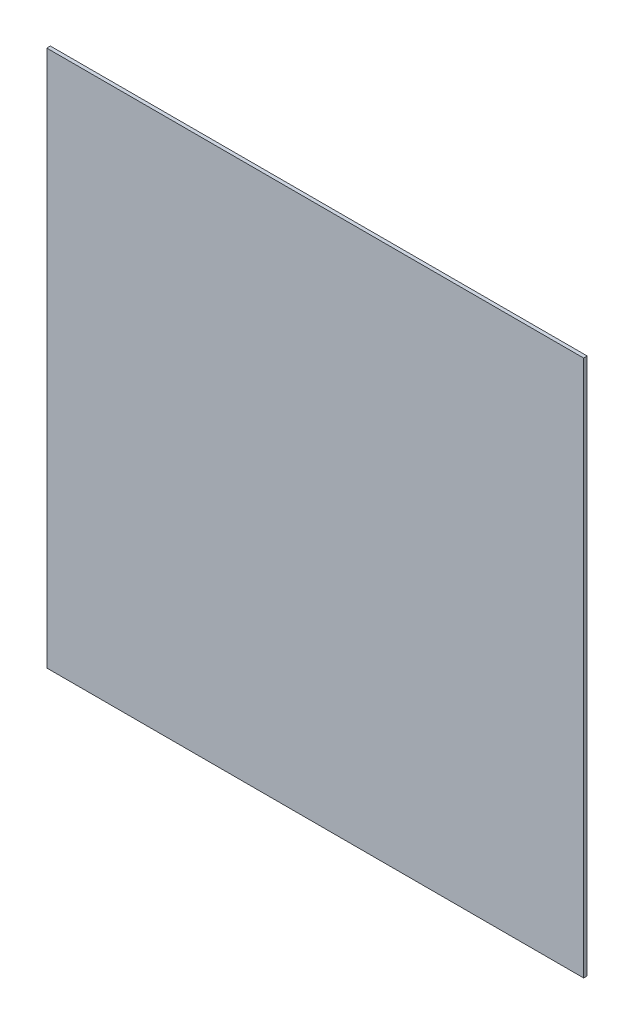
ISO-10303-21;
HEADER;
FILE_DESCRIPTION(('STEP AP214'),'2;1');
FILE_NAME('part.step','',(''),(''),'','','');
FILE_SCHEMA(('AUTOMOTIVE_DESIGN { 1 0 10303 214 1 1 1 1 }'));
ENDSEC;
DATA;
#1=APPLICATION_CONTEXT('core data for automotive mechanical design processes');
#2=APPLICATION_PROTOCOL_DEFINITION('international standard','automotive_design',2000,#1);
#3=PRODUCT_CONTEXT('',#1,'mechanical');
#4=PRODUCT('Part','Part','',(#3));
#5=PRODUCT_RELATED_PRODUCT_CATEGORY('part','',(#4));
#6=PRODUCT_DEFINITION_FORMATION('','',#4);
#7=PRODUCT_DEFINITION_CONTEXT('part definition',#1,'design');
#8=PRODUCT_DEFINITION('design','',#6,#7);
#9=PRODUCT_DEFINITION_SHAPE('','',#8);
#10=(LENGTH_UNIT() NAMED_UNIT(*) SI_UNIT(.MILLI.,.METRE.));
#11=(NAMED_UNIT(*) PLANE_ANGLE_UNIT() SI_UNIT($,.RADIAN.));
#12=(NAMED_UNIT(*) SI_UNIT($,.STERADIAN.) SOLID_ANGLE_UNIT());
#13=UNCERTAINTY_MEASURE_WITH_UNIT(LENGTH_MEASURE(1.E-05),#10,'distance_accuracy_value','');
#14=(GEOMETRIC_REPRESENTATION_CONTEXT(3) GLOBAL_UNCERTAINTY_ASSIGNED_CONTEXT((#13)) GLOBAL_UNIT_ASSIGNED_CONTEXT((#10,
#11,#12)) REPRESENTATION_CONTEXT('',''));
#15=CARTESIAN_POINT('',(0.,0.,0.));
#16=DIRECTION('',(0.,0.,1.));
#17=DIRECTION('',(1.,0.,0.));
#18=AXIS2_PLACEMENT_3D('',#15,#16,#17);
#19=CARTESIAN_POINT('',(150.,-150.,2.));
#20=DIRECTION('',(-1.,0.,0.));
#21=DIRECTION('',(0.,0.,1.));
#22=AXIS2_PLACEMENT_3D('',#19,#20,#21);
#23=PLANE('',#22);
#24=DIRECTION('',(0.,1.,0.));
#25=VECTOR('',#24,1.);
#26=CARTESIAN_POINT('',(150.,-150.,0.));
#27=LINE('',#26,#25);
#28=CARTESIAN_POINT('',(150.,-150.,0.));
#29=VERTEX_POINT('',#28);
#30=CARTESIAN_POINT('',(150.,150.,0.));
#31=VERTEX_POINT('',#30);
#32=EDGE_CURVE('E115',#29,#31,#27,.T.);
#33=ORIENTED_EDGE('',*,*,#32,.T.);
#34=DIRECTION('',(0.,0.,-1.));
#35=VECTOR('',#34,1.);
#36=CARTESIAN_POINT('',(150.,150.,2.));
#37=LINE('',#36,#35);
#38=CARTESIAN_POINT('',(150.,150.,2.));
#39=VERTEX_POINT('',#38);
#40=EDGE_CURVE('E11',#39,#31,#37,.T.);
#41=ORIENTED_EDGE('',*,*,#40,.F.);
#42=DIRECTION('',(0.,1.,0.));
#43=VECTOR('',#42,1.);
#44=CARTESIAN_POINT('',(150.,-150.,2.));
#45=LINE('',#44,#43);
#46=CARTESIAN_POINT('',(150.,-150.,2.));
#47=VERTEX_POINT('',#46);
#48=EDGE_CURVE('E99',#47,#39,#45,.T.);
#49=ORIENTED_EDGE('',*,*,#48,.F.);
#50=DIRECTION('',(0.,0.,-1.));
#51=VECTOR('',#50,1.);
#52=CARTESIAN_POINT('',(150.,-150.,2.));
#53=LINE('',#52,#51);
#54=EDGE_CURVE('E111',#47,#29,#53,.T.);
#55=ORIENTED_EDGE('',*,*,#54,.T.);
#56=EDGE_LOOP('',(#33,#41,#49,#55));
#57=FACE_BOUND('',#56,.T.);
#58=ADVANCED_FACE('F47',(#57),#23,.F.);
#59=CARTESIAN_POINT('',(-150.,150.,2.));
#60=DIRECTION('',(0.,-1.,0.));
#61=DIRECTION('',(0.,0.,-1.));
#62=AXIS2_PLACEMENT_3D('',#59,#60,#61);
#63=PLANE('',#62);
#64=DIRECTION('',(-1.,0.,0.));
#65=VECTOR('',#64,1.);
#66=CARTESIAN_POINT('',(-150.,150.,0.));
#67=LINE('',#66,#65);
#68=CARTESIAN_POINT('',(-150.,150.,0.));
#69=VERTEX_POINT('',#68);
#70=EDGE_CURVE('E104',#31,#69,#67,.T.);
#71=ORIENTED_EDGE('',*,*,#70,.T.);
#72=DIRECTION('',(0.,0.,-1.));
#73=VECTOR('',#72,1.);
#74=CARTESIAN_POINT('',(-150.,150.,2.));
#75=LINE('',#74,#73);
#76=CARTESIAN_POINT('',(-150.,150.,2.));
#77=VERTEX_POINT('',#76);
#78=EDGE_CURVE('E56',#77,#69,#75,.T.);
#79=ORIENTED_EDGE('',*,*,#78,.F.);
#80=DIRECTION('',(-1.,0.,0.));
#81=VECTOR('',#80,1.);
#82=CARTESIAN_POINT('',(-150.,150.,2.));
#83=LINE('',#82,#81);
#84=EDGE_CURVE('E94',#39,#77,#83,.T.);
#85=ORIENTED_EDGE('',*,*,#84,.F.);
#86=ORIENTED_EDGE('',*,*,#40,.T.);
#87=EDGE_LOOP('',(#71,#79,#85,#86));
#88=FACE_BOUND('',#87,.T.);
#89=ADVANCED_FACE('F103',(#88),#63,.F.);
#90=CARTESIAN_POINT('',(-150.,-150.,2.));
#91=DIRECTION('',(1.,0.,0.));
#92=DIRECTION('',(0.,0.,-1.));
#93=AXIS2_PLACEMENT_3D('',#90,#91,#92);
#94=PLANE('',#93);
#95=DIRECTION('',(0.,-1.,0.));
#96=VECTOR('',#95,1.);
#97=CARTESIAN_POINT('',(-150.,-150.,0.));
#98=LINE('',#97,#96);
#99=CARTESIAN_POINT('',(-150.,-150.,0.));
#100=VERTEX_POINT('',#99);
#101=EDGE_CURVE('E81',#69,#100,#98,.T.);
#102=ORIENTED_EDGE('',*,*,#101,.T.);
#103=DIRECTION('',(0.,0.,-1.));
#104=VECTOR('',#103,1.);
#105=CARTESIAN_POINT('',(-150.,-150.,2.));
#106=LINE('',#105,#104);
#107=CARTESIAN_POINT('',(-150.,-150.,2.));
#108=VERTEX_POINT('',#107);
#109=EDGE_CURVE('E106',#108,#100,#106,.T.);
#110=ORIENTED_EDGE('',*,*,#109,.F.);
#111=DIRECTION('',(0.,-1.,0.));
#112=VECTOR('',#111,1.);
#113=CARTESIAN_POINT('',(-150.,-150.,2.));
#114=LINE('',#113,#112);
#115=EDGE_CURVE('E97',#77,#108,#114,.T.);
#116=ORIENTED_EDGE('',*,*,#115,.F.);
#117=ORIENTED_EDGE('',*,*,#78,.T.);
#118=EDGE_LOOP('',(#102,#110,#116,#117));
#119=FACE_BOUND('',#118,.T.);
#120=ADVANCED_FACE('F107',(#119),#94,.F.);
#121=CARTESIAN_POINT('',(-150.,-150.,2.));
#122=DIRECTION('',(0.,1.,0.));
#123=DIRECTION('',(-1.,0.,0.));
#124=AXIS2_PLACEMENT_3D('',#121,#122,#123);
#125=PLANE('',#124);
#126=DIRECTION('',(1.,0.,0.));
#127=VECTOR('',#126,1.);
#128=CARTESIAN_POINT('',(-150.,-150.,0.));
#129=LINE('',#128,#127);
#130=EDGE_CURVE('E87',#100,#29,#129,.T.);
#131=ORIENTED_EDGE('',*,*,#130,.T.);
#132=ORIENTED_EDGE('',*,*,#54,.F.);
#133=DIRECTION('',(1.,0.,0.));
#134=VECTOR('',#133,1.);
#135=CARTESIAN_POINT('',(-150.,-150.,2.));
#136=LINE('',#135,#134);
#137=EDGE_CURVE('E64',#108,#47,#136,.T.);
#138=ORIENTED_EDGE('',*,*,#137,.F.);
#139=ORIENTED_EDGE('',*,*,#109,.T.);
#140=EDGE_LOOP('',(#131,#132,#138,#139));
#141=FACE_BOUND('',#140,.T.);
#142=ADVANCED_FACE('F128',(#141),#125,.F.);
#143=CARTESIAN_POINT('',(0.,0.,2.));
#144=DIRECTION('',(0.,0.,-1.));
#145=DIRECTION('',(-1.,0.,0.));
#146=AXIS2_PLACEMENT_3D('',#143,#144,#145);
#147=PLANE('',#146);
#148=ORIENTED_EDGE('',*,*,#48,.T.);
#149=ORIENTED_EDGE('',*,*,#84,.T.);
#150=ORIENTED_EDGE('',*,*,#115,.T.);
#151=ORIENTED_EDGE('',*,*,#137,.T.);
#152=EDGE_LOOP('',(#148,#149,#150,#151));
#153=FACE_BOUND('',#152,.T.);
#154=ADVANCED_FACE('F95',(#153),#147,.F.);
#155=CARTESIAN_POINT('',(0.,0.,0.));
#156=DIRECTION('',(0.,0.,-1.));
#157=DIRECTION('',(-1.,0.,0.));
#158=AXIS2_PLACEMENT_3D('',#155,#156,#157);
#159=PLANE('',#158);
#160=ORIENTED_EDGE('',*,*,#32,.F.);
#161=ORIENTED_EDGE('',*,*,#130,.F.);
#162=ORIENTED_EDGE('',*,*,#101,.F.);
#163=ORIENTED_EDGE('',*,*,#70,.F.);
#164=EDGE_LOOP('',(#160,#161,#162,#163));
#165=FACE_BOUND('',#164,.T.);
#166=ADVANCED_FACE('F131',(#165),#159,.T.);
#167=CLOSED_SHELL('',(#58,#89,#120,#142,#154,#166));
#168=MANIFOLD_SOLID_BREP('B2',#167);
#169=ADVANCED_BREP_SHAPE_REPRESENTATION('',(#18,#168),#14);
#170=SHAPE_DEFINITION_REPRESENTATION(#9,#169);
ENDSEC;
END-ISO-10303-21;
